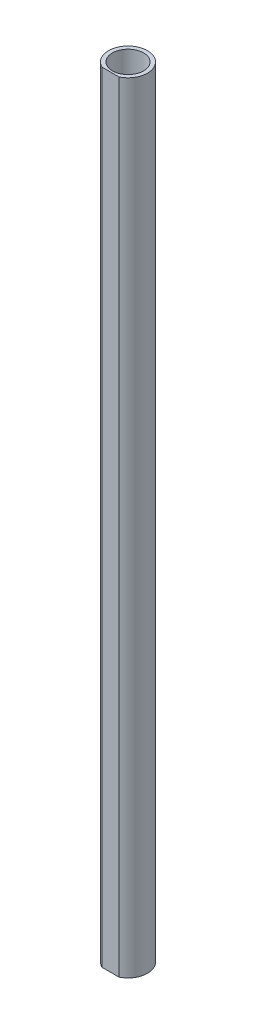
ISO-10303-21;
HEADER;
FILE_DESCRIPTION(('STEP AP214'),'2;1');
FILE_NAME('part.step','',(''),(''),'','','');
FILE_SCHEMA(('AUTOMOTIVE_DESIGN { 1 0 10303 214 1 1 1 1 }'));
ENDSEC;
DATA;
#1=APPLICATION_CONTEXT('core data for automotive mechanical design processes');
#2=APPLICATION_PROTOCOL_DEFINITION('international standard','automotive_design',2000,#1);
#3=PRODUCT_CONTEXT('',#1,'mechanical');
#4=PRODUCT('Part','Part','',(#3));
#5=PRODUCT_RELATED_PRODUCT_CATEGORY('part','',(#4));
#6=PRODUCT_DEFINITION_FORMATION('','',#4);
#7=PRODUCT_DEFINITION_CONTEXT('part definition',#1,'design');
#8=PRODUCT_DEFINITION('design','',#6,#7);
#9=PRODUCT_DEFINITION_SHAPE('','',#8);
#10=(LENGTH_UNIT() NAMED_UNIT(*) SI_UNIT(.MILLI.,.METRE.));
#11=(NAMED_UNIT(*) PLANE_ANGLE_UNIT() SI_UNIT($,.RADIAN.));
#12=(NAMED_UNIT(*) SI_UNIT($,.STERADIAN.) SOLID_ANGLE_UNIT());
#13=UNCERTAINTY_MEASURE_WITH_UNIT(LENGTH_MEASURE(1.E-05),#10,'distance_accuracy_value','');
#14=(GEOMETRIC_REPRESENTATION_CONTEXT(3) GLOBAL_UNCERTAINTY_ASSIGNED_CONTEXT((#13)) GLOBAL_UNIT_ASSIGNED_CONTEXT((#10,
#11,#12)) REPRESENTATION_CONTEXT('',''));
#15=CARTESIAN_POINT('',(0.,0.,0.));
#16=DIRECTION('',(0.,0.,1.));
#17=DIRECTION('',(1.,0.,0.));
#18=AXIS2_PLACEMENT_3D('',#15,#16,#17);
#19=CARTESIAN_POINT('',(0.,1000.,0.));
#20=DIRECTION('',(0.,1.,0.));
#21=DIRECTION('',(0.,0.,1.));
#22=AXIS2_PLACEMENT_3D('',#19,#20,#21);
#23=PLANE('',#22);
#24=DIRECTION('',(-1.,0.,0.));
#25=VECTOR('',#24,1.);
#26=CARTESIAN_POINT('',(0.,1000.,22.5));
#27=LINE('',#26,#25);
#28=CARTESIAN_POINT('',(10.8972473588517,1000.,22.5));
#29=VERTEX_POINT('',#28);
#30=CARTESIAN_POINT('',(-10.8972473588517,1000.,22.5));
#31=VERTEX_POINT('',#30);
#32=EDGE_CURVE('E54',#29,#31,#27,.T.);
#33=ORIENTED_EDGE('',*,*,#32,.F.);
#34=CARTESIAN_POINT('',(0.,1000.,0.));
#35=DIRECTION('',(0.,1.,0.));
#36=DIRECTION('',(0.,0.,1.));
#37=AXIS2_PLACEMENT_3D('',#34,#35,#36);
#38=CIRCLE('',#37,25.);
#39=EDGE_CURVE('E71',#29,#31,#38,.T.);
#40=ORIENTED_EDGE('',*,*,#39,.T.);
#41=EDGE_LOOP('',(#33,#40));
#42=FACE_BOUND('',#41,.T.);
#43=CARTESIAN_POINT('',(0.,1000.,0.));
#44=DIRECTION('',(0.,1.,0.));
#45=DIRECTION('',(0.,0.,1.));
#46=AXIS2_PLACEMENT_3D('',#43,#44,#45);
#47=CIRCLE('',#46,20.);
#48=CARTESIAN_POINT('',(0.,1000.,20.));
#49=VERTEX_POINT('',#48);
#50=EDGE_CURVE('E80',#49,#49,#47,.T.);
#51=ORIENTED_EDGE('',*,*,#50,.F.);
#52=EDGE_LOOP('',(#51));
#53=FACE_BOUND('',#52,.T.);
#54=ADVANCED_FACE('F38',(#42,#53),#23,.T.);
#55=CARTESIAN_POINT('',(0.,0.,0.));
#56=DIRECTION('',(0.,1.,0.));
#57=DIRECTION('',(0.,0.,1.));
#58=AXIS2_PLACEMENT_3D('',#55,#56,#57);
#59=PLANE('',#58);
#60=CARTESIAN_POINT('',(0.,0.,0.));
#61=DIRECTION('',(0.,1.,0.));
#62=DIRECTION('',(0.,0.,1.));
#63=AXIS2_PLACEMENT_3D('',#60,#61,#62);
#64=CIRCLE('',#63,25.);
#65=CARTESIAN_POINT('',(10.8972473588517,0.,22.5));
#66=VERTEX_POINT('',#65);
#67=CARTESIAN_POINT('',(-10.8972473588517,0.,22.5));
#68=VERTEX_POINT('',#67);
#69=EDGE_CURVE('E76',#66,#68,#64,.T.);
#70=ORIENTED_EDGE('',*,*,#69,.F.);
#71=DIRECTION('',(-1.,0.,0.));
#72=VECTOR('',#71,1.);
#73=CARTESIAN_POINT('',(0.,0.,22.5));
#74=LINE('',#73,#72);
#75=EDGE_CURVE('E63',#66,#68,#74,.T.);
#76=ORIENTED_EDGE('',*,*,#75,.T.);
#77=EDGE_LOOP('',(#70,#76));
#78=FACE_BOUND('',#77,.T.);
#79=CARTESIAN_POINT('',(0.,0.,0.));
#80=DIRECTION('',(0.,1.,0.));
#81=DIRECTION('',(0.,0.,1.));
#82=AXIS2_PLACEMENT_3D('',#79,#80,#81);
#83=CIRCLE('',#82,20.);
#84=CARTESIAN_POINT('',(0.,0.,20.));
#85=VERTEX_POINT('',#84);
#86=EDGE_CURVE('E73',#85,#85,#83,.T.);
#87=ORIENTED_EDGE('',*,*,#86,.T.);
#88=EDGE_LOOP('',(#87));
#89=FACE_BOUND('',#88,.T.);
#90=ADVANCED_FACE('F91',(#78,#89),#59,.F.);
#91=CARTESIAN_POINT('',(0.,1000.,0.));
#92=DIRECTION('',(0.,-1.,0.));
#93=DIRECTION('',(0.,0.,-1.));
#94=AXIS2_PLACEMENT_3D('',#91,#92,#93);
#95=CYLINDRICAL_SURFACE('',#94,25.);
#96=ORIENTED_EDGE('',*,*,#39,.F.);
#97=DIRECTION('',(0.,-1.,0.));
#98=VECTOR('',#97,1.);
#99=CARTESIAN_POINT('',(10.8972473588517,1000.,22.5));
#100=LINE('',#99,#98);
#101=EDGE_CURVE('E11',#29,#66,#100,.T.);
#102=ORIENTED_EDGE('',*,*,#101,.T.);
#103=ORIENTED_EDGE('',*,*,#69,.T.);
#104=DIRECTION('',(0.,-1.,0.));
#105=VECTOR('',#104,1.);
#106=CARTESIAN_POINT('',(-10.8972473588517,1000.,22.5));
#107=LINE('',#106,#105);
#108=EDGE_CURVE('E47',#68,#31,#107,.F.);
#109=ORIENTED_EDGE('',*,*,#108,.T.);
#110=EDGE_LOOP('',(#96,#102,#103,#109));
#111=FACE_BOUND('',#110,.T.);
#112=ADVANCED_FACE('F40',(#111),#95,.T.);
#113=CARTESIAN_POINT('',(0.,1000.,0.));
#114=DIRECTION('',(0.,-1.,0.));
#115=DIRECTION('',(0.,0.,-1.));
#116=AXIS2_PLACEMENT_3D('',#113,#114,#115);
#117=CYLINDRICAL_SURFACE('',#116,20.);
#118=ORIENTED_EDGE('',*,*,#50,.T.);
#119=EDGE_LOOP('',(#118));
#120=FACE_BOUND('',#119,.T.);
#121=ORIENTED_EDGE('',*,*,#86,.F.);
#122=EDGE_LOOP('',(#121));
#123=FACE_BOUND('',#122,.T.);
#124=ADVANCED_FACE('F96',(#120,#123),#117,.F.);
#125=CARTESIAN_POINT('',(-10.8972473588517,2253.12110348521,22.5));
#126=DIRECTION('',(0.,0.,-1.));
#127=DIRECTION('',(-1.,0.,0.));
#128=AXIS2_PLACEMENT_3D('',#125,#126,#127);
#129=PLANE('',#128);
#130=ORIENTED_EDGE('',*,*,#101,.F.);
#131=ORIENTED_EDGE('',*,*,#32,.T.);
#132=ORIENTED_EDGE('',*,*,#108,.F.);
#133=ORIENTED_EDGE('',*,*,#75,.F.);
#134=EDGE_LOOP('',(#130,#131,#132,#133));
#135=FACE_BOUND('',#134,.T.);
#136=ADVANCED_FACE('F62',(#135),#129,.F.);
#137=CLOSED_SHELL('',(#54,#90,#112,#124,#136));
#138=MANIFOLD_SOLID_BREP('B2',#137);
#139=ADVANCED_BREP_SHAPE_REPRESENTATION('',(#18,#138),#14);
#140=SHAPE_DEFINITION_REPRESENTATION(#9,#139);
ENDSEC;
END-ISO-10303-21;
